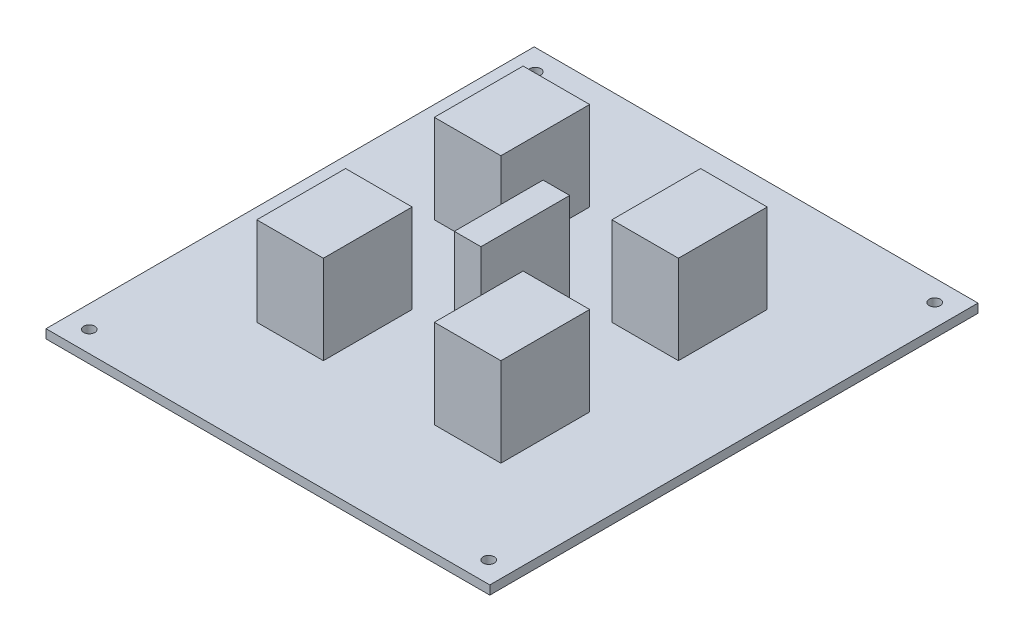
ISO-10303-21;
HEADER;
FILE_DESCRIPTION(('STEP AP214'),'2;1');
FILE_NAME('part.step','',(''),(''),'','','');
FILE_SCHEMA(('AUTOMOTIVE_DESIGN { 1 0 10303 214 1 1 1 1 }'));
ENDSEC;
DATA;
#1=APPLICATION_CONTEXT('core data for automotive mechanical design processes');
#2=APPLICATION_PROTOCOL_DEFINITION('international standard','automotive_design',2000,#1);
#3=PRODUCT_CONTEXT('',#1,'mechanical');
#4=PRODUCT('Part','Part','',(#3));
#5=PRODUCT_RELATED_PRODUCT_CATEGORY('part','',(#4));
#6=PRODUCT_DEFINITION_FORMATION('','',#4);
#7=PRODUCT_DEFINITION_CONTEXT('part definition',#1,'design');
#8=PRODUCT_DEFINITION('design','',#6,#7);
#9=PRODUCT_DEFINITION_SHAPE('','',#8);
#10=(LENGTH_UNIT() NAMED_UNIT(*) SI_UNIT(.MILLI.,.METRE.));
#11=(NAMED_UNIT(*) PLANE_ANGLE_UNIT() SI_UNIT($,.RADIAN.));
#12=(NAMED_UNIT(*) SI_UNIT($,.STERADIAN.) SOLID_ANGLE_UNIT());
#13=UNCERTAINTY_MEASURE_WITH_UNIT(LENGTH_MEASURE(1.E-05),#10,'distance_accuracy_value','');
#14=(GEOMETRIC_REPRESENTATION_CONTEXT(3) GLOBAL_UNCERTAINTY_ASSIGNED_CONTEXT((#13)) GLOBAL_UNIT_ASSIGNED_CONTEXT((#10,
#11,#12)) REPRESENTATION_CONTEXT('',''));
#15=CARTESIAN_POINT('',(0.,0.,0.));
#16=DIRECTION('',(0.,0.,1.));
#17=DIRECTION('',(1.,0.,0.));
#18=AXIS2_PLACEMENT_3D('',#15,#16,#17);
#19=CARTESIAN_POINT('',(0.,2.,0.));
#20=DIRECTION('',(0.,-1.,0.));
#21=DIRECTION('',(0.,0.,-1.));
#22=AXIS2_PLACEMENT_3D('',#19,#20,#21);
#23=PLANE('',#22);
#24=DIRECTION('',(0.,0.,-1.));
#25=VECTOR('',#24,1.);
#26=CARTESIAN_POINT('',(27.5,2.,30.));
#27=LINE('',#26,#25);
#28=CARTESIAN_POINT('',(27.5,2.,30.));
#29=VERTEX_POINT('',#28);
#30=CARTESIAN_POINT('',(27.5,2.,10.));
#31=VERTEX_POINT('',#30);
#32=EDGE_CURVE('E214',#29,#31,#27,.T.);
#33=ORIENTED_EDGE('',*,*,#32,.F.);
#34=DIRECTION('',(1.,0.,0.));
#35=VECTOR('',#34,1.);
#36=CARTESIAN_POINT('',(27.5,2.,30.));
#37=LINE('',#36,#35);
#38=CARTESIAN_POINT('',(12.5,2.,30.));
#39=VERTEX_POINT('',#38);
#40=EDGE_CURVE('E227',#39,#29,#37,.T.);
#41=ORIENTED_EDGE('',*,*,#40,.F.);
#42=DIRECTION('',(0.,0.,1.));
#43=VECTOR('',#42,1.);
#44=CARTESIAN_POINT('',(12.5,2.,30.));
#45=LINE('',#44,#43);
#46=CARTESIAN_POINT('',(12.5,2.,10.));
#47=VERTEX_POINT('',#46);
#48=EDGE_CURVE('E236',#47,#39,#45,.T.);
#49=ORIENTED_EDGE('',*,*,#48,.F.);
#50=DIRECTION('',(-1.,0.,0.));
#51=VECTOR('',#50,1.);
#52=CARTESIAN_POINT('',(27.5,2.,10.));
#53=LINE('',#52,#51);
#54=EDGE_CURVE('E217',#31,#47,#53,.T.);
#55=ORIENTED_EDGE('',*,*,#54,.F.);
#56=EDGE_LOOP('',(#33,#41,#49,#55));
#57=FACE_BOUND('',#56,.T.);
#58=DIRECTION('',(0.,0.,-1.));
#59=VECTOR('',#58,1.);
#60=CARTESIAN_POINT('',(-12.5,2.,30.));
#61=LINE('',#60,#59);
#62=CARTESIAN_POINT('',(-12.5,2.,30.));
#63=VERTEX_POINT('',#62);
#64=CARTESIAN_POINT('',(-12.5,2.,10.));
#65=VERTEX_POINT('',#64);
#66=EDGE_CURVE('E285',#63,#65,#61,.T.);
#67=ORIENTED_EDGE('',*,*,#66,.F.);
#68=DIRECTION('',(1.,0.,0.));
#69=VECTOR('',#68,1.);
#70=CARTESIAN_POINT('',(-27.5,2.,30.));
#71=LINE('',#70,#69);
#72=CARTESIAN_POINT('',(-27.5,2.,30.));
#73=VERTEX_POINT('',#72);
#74=EDGE_CURVE('E290',#73,#63,#71,.T.);
#75=ORIENTED_EDGE('',*,*,#74,.F.);
#76=DIRECTION('',(0.,0.,1.));
#77=VECTOR('',#76,1.);
#78=CARTESIAN_POINT('',(-27.5,2.,30.));
#79=LINE('',#78,#77);
#80=CARTESIAN_POINT('',(-27.5,2.,10.));
#81=VERTEX_POINT('',#80);
#82=EDGE_CURVE('E302',#81,#73,#79,.T.);
#83=ORIENTED_EDGE('',*,*,#82,.F.);
#84=DIRECTION('',(-1.,0.,0.));
#85=VECTOR('',#84,1.);
#86=CARTESIAN_POINT('',(-27.5,2.,10.));
#87=LINE('',#86,#85);
#88=EDGE_CURVE('E299',#65,#81,#87,.T.);
#89=ORIENTED_EDGE('',*,*,#88,.F.);
#90=EDGE_LOOP('',(#67,#75,#83,#89));
#91=FACE_BOUND('',#90,.T.);
#92=CARTESIAN_POINT('',(-45.,2.,50.25));
#93=DIRECTION('',(0.,1.,0.));
#94=DIRECTION('',(0.,0.,-1.));
#95=AXIS2_PLACEMENT_3D('',#92,#93,#94);
#96=CIRCLE('',#95,1.25);
#97=CARTESIAN_POINT('',(-45.,2.,49.));
#98=VERTEX_POINT('',#97);
#99=EDGE_CURVE('E352',#98,#98,#96,.T.);
#100=ORIENTED_EDGE('',*,*,#99,.F.);
#101=EDGE_LOOP('',(#100));
#102=FACE_BOUND('',#101,.T.);
#103=CARTESIAN_POINT('',(45.,2.,50.25));
#104=DIRECTION('',(0.,1.,0.));
#105=DIRECTION('',(0.,0.,-1.));
#106=AXIS2_PLACEMENT_3D('',#103,#104,#105);
#107=CIRCLE('',#106,1.25);
#108=CARTESIAN_POINT('',(45.,2.,49.));
#109=VERTEX_POINT('',#108);
#110=EDGE_CURVE('E358',#109,#109,#107,.T.);
#111=ORIENTED_EDGE('',*,*,#110,.F.);
#112=EDGE_LOOP('',(#111));
#113=FACE_BOUND('',#112,.T.);
#114=CARTESIAN_POINT('',(45.,2.,-50.25));
#115=DIRECTION('',(0.,1.,0.));
#116=DIRECTION('',(0.,0.,1.));
#117=AXIS2_PLACEMENT_3D('',#114,#115,#116);
#118=CIRCLE('',#117,1.25);
#119=CARTESIAN_POINT('',(45.,2.,-49.));
#120=VERTEX_POINT('',#119);
#121=EDGE_CURVE('E364',#120,#120,#118,.T.);
#122=ORIENTED_EDGE('',*,*,#121,.F.);
#123=EDGE_LOOP('',(#122));
#124=FACE_BOUND('',#123,.T.);
#125=CARTESIAN_POINT('',(-45.,2.,-50.25));
#126=DIRECTION('',(0.,1.,0.));
#127=DIRECTION('',(0.,0.,1.));
#128=AXIS2_PLACEMENT_3D('',#125,#126,#127);
#129=CIRCLE('',#128,1.25);
#130=CARTESIAN_POINT('',(-45.,2.,-49.));
#131=VERTEX_POINT('',#130);
#132=EDGE_CURVE('E370',#131,#131,#129,.T.);
#133=ORIENTED_EDGE('',*,*,#132,.F.);
#134=EDGE_LOOP('',(#133));
#135=FACE_BOUND('',#134,.T.);
#136=DIRECTION('',(0.,0.,-1.));
#137=VECTOR('',#136,1.);
#138=CARTESIAN_POINT('',(50.,2.,55.));
#139=LINE('',#138,#137);
#140=CARTESIAN_POINT('',(50.,2.,55.));
#141=VERTEX_POINT('',#140);
#142=CARTESIAN_POINT('',(50.,2.,-55.));
#143=VERTEX_POINT('',#142);
#144=EDGE_CURVE('E376',#141,#143,#139,.T.);
#145=ORIENTED_EDGE('',*,*,#144,.T.);
#146=DIRECTION('',(-1.,0.,0.));
#147=VECTOR('',#146,1.);
#148=CARTESIAN_POINT('',(-50.,2.,-55.));
#149=LINE('',#148,#147);
#150=CARTESIAN_POINT('',(-50.,2.,-55.));
#151=VERTEX_POINT('',#150);
#152=EDGE_CURVE('E379',#143,#151,#149,.T.);
#153=ORIENTED_EDGE('',*,*,#152,.T.);
#154=DIRECTION('',(0.,0.,1.));
#155=VECTOR('',#154,1.);
#156=CARTESIAN_POINT('',(-50.,2.,55.));
#157=LINE('',#156,#155);
#158=CARTESIAN_POINT('',(-50.,2.,55.));
#159=VERTEX_POINT('',#158);
#160=EDGE_CURVE('E382',#151,#159,#157,.T.);
#161=ORIENTED_EDGE('',*,*,#160,.T.);
#162=DIRECTION('',(1.,0.,0.));
#163=VECTOR('',#162,1.);
#164=CARTESIAN_POINT('',(-50.,2.,55.));
#165=LINE('',#164,#163);
#166=EDGE_CURVE('E384',#159,#141,#165,.T.);
#167=ORIENTED_EDGE('',*,*,#166,.T.);
#168=EDGE_LOOP('',(#145,#153,#161,#167));
#169=FACE_BOUND('',#168,.T.);
#170=DIRECTION('',(0.,0.,1.));
#171=VECTOR('',#170,1.);
#172=CARTESIAN_POINT('',(-27.5,2.,-30.));
#173=LINE('',#172,#171);
#174=CARTESIAN_POINT('',(-27.5,2.,-30.));
#175=VERTEX_POINT('',#174);
#176=CARTESIAN_POINT('',(-27.5,2.,-10.));
#177=VERTEX_POINT('',#176);
#178=EDGE_CURVE('E318',#175,#177,#173,.T.);
#179=ORIENTED_EDGE('',*,*,#178,.F.);
#180=DIRECTION('',(-1.,0.,0.));
#181=VECTOR('',#180,1.);
#182=CARTESIAN_POINT('',(-27.5,2.,-30.));
#183=LINE('',#182,#181);
#184=CARTESIAN_POINT('',(-12.5,2.,-30.));
#185=VERTEX_POINT('',#184);
#186=EDGE_CURVE('E323',#185,#175,#183,.T.);
#187=ORIENTED_EDGE('',*,*,#186,.F.);
#188=DIRECTION('',(0.,0.,-1.));
#189=VECTOR('',#188,1.);
#190=CARTESIAN_POINT('',(-12.5,2.,-30.));
#191=LINE('',#190,#189);
#192=CARTESIAN_POINT('',(-12.5,2.,-10.));
#193=VERTEX_POINT('',#192);
#194=EDGE_CURVE('E335',#193,#185,#191,.T.);
#195=ORIENTED_EDGE('',*,*,#194,.F.);
#196=DIRECTION('',(1.,0.,0.));
#197=VECTOR('',#196,1.);
#198=CARTESIAN_POINT('',(-27.5,2.,-10.));
#199=LINE('',#198,#197);
#200=EDGE_CURVE('E332',#177,#193,#199,.T.);
#201=ORIENTED_EDGE('',*,*,#200,.F.);
#202=EDGE_LOOP('',(#179,#187,#195,#201));
#203=FACE_BOUND('',#202,.T.);
#204=DIRECTION('',(0.,0.,1.));
#205=VECTOR('',#204,1.);
#206=CARTESIAN_POINT('',(-2.99999999999999,2.,-10.));
#207=LINE('',#206,#205);
#208=CARTESIAN_POINT('',(-2.99999999999999,2.,-10.));
#209=VERTEX_POINT('',#208);
#210=CARTESIAN_POINT('',(-2.99999999999999,2.,10.));
#211=VERTEX_POINT('',#210);
#212=EDGE_CURVE('E252',#209,#211,#207,.T.);
#213=ORIENTED_EDGE('',*,*,#212,.F.);
#214=DIRECTION('',(-1.,0.,0.));
#215=VECTOR('',#214,1.);
#216=CARTESIAN_POINT('',(3.00000000000002,2.,-10.));
#217=LINE('',#216,#215);
#218=CARTESIAN_POINT('',(3.00000000000002,2.,-10.));
#219=VERTEX_POINT('',#218);
#220=EDGE_CURVE('E257',#219,#209,#217,.T.);
#221=ORIENTED_EDGE('',*,*,#220,.F.);
#222=DIRECTION('',(0.,0.,-1.));
#223=VECTOR('',#222,1.);
#224=CARTESIAN_POINT('',(3.00000000000002,2.,-10.));
#225=LINE('',#224,#223);
#226=CARTESIAN_POINT('',(3.00000000000002,2.,10.));
#227=VERTEX_POINT('',#226);
#228=EDGE_CURVE('E269',#227,#219,#225,.T.);
#229=ORIENTED_EDGE('',*,*,#228,.F.);
#230=DIRECTION('',(1.,0.,0.));
#231=VECTOR('',#230,1.);
#232=CARTESIAN_POINT('',(-2.99999999999999,2.,10.));
#233=LINE('',#232,#231);
#234=EDGE_CURVE('E266',#211,#227,#233,.T.);
#235=ORIENTED_EDGE('',*,*,#234,.F.);
#236=EDGE_LOOP('',(#213,#221,#229,#235));
#237=FACE_BOUND('',#236,.T.);
#238=DIRECTION('',(0.,0.,-1.));
#239=VECTOR('',#238,1.);
#240=CARTESIAN_POINT('',(27.5,2.,-30.));
#241=LINE('',#240,#239);
#242=CARTESIAN_POINT('',(27.5,2.,-10.));
#243=VERTEX_POINT('',#242);
#244=CARTESIAN_POINT('',(27.5,2.,-30.));
#245=VERTEX_POINT('',#244);
#246=EDGE_CURVE('E213',#243,#245,#241,.T.);
#247=ORIENTED_EDGE('',*,*,#246,.F.);
#248=DIRECTION('',(1.,0.,0.));
#249=VECTOR('',#248,1.);
#250=CARTESIAN_POINT('',(27.5,2.,-10.));
#251=LINE('',#250,#249);
#252=CARTESIAN_POINT('',(12.5,2.,-10.));
#253=VERTEX_POINT('',#252);
#254=EDGE_CURVE('E210',#253,#243,#251,.T.);
#255=ORIENTED_EDGE('',*,*,#254,.F.);
#256=DIRECTION('',(0.,0.,1.));
#257=VECTOR('',#256,1.);
#258=CARTESIAN_POINT('',(12.5,2.,-30.));
#259=LINE('',#258,#257);
#260=CARTESIAN_POINT('',(12.5,2.,-30.));
#261=VERTEX_POINT('',#260);
#262=EDGE_CURVE('E52',#261,#253,#259,.T.);
#263=ORIENTED_EDGE('',*,*,#262,.F.);
#264=DIRECTION('',(-1.,0.,0.));
#265=VECTOR('',#264,1.);
#266=CARTESIAN_POINT('',(27.5,2.,-30.));
#267=LINE('',#266,#265);
#268=EDGE_CURVE('E47',#245,#261,#267,.T.);
#269=ORIENTED_EDGE('',*,*,#268,.F.);
#270=EDGE_LOOP('',(#247,#255,#263,#269));
#271=FACE_BOUND('',#270,.T.);
#272=ADVANCED_FACE('F32',(#57,#91,#102,#113,#124,#135,#169,#203,#237,#271),#23,.F.);
#273=CARTESIAN_POINT('',(0.,0.,0.));
#274=DIRECTION('',(0.,-1.,0.));
#275=DIRECTION('',(0.,0.,-1.));
#276=AXIS2_PLACEMENT_3D('',#273,#274,#275);
#277=PLANE('',#276);
#278=CARTESIAN_POINT('',(45.,0.,50.25));
#279=DIRECTION('',(0.,1.,0.));
#280=DIRECTION('',(0.,0.,-1.));
#281=AXIS2_PLACEMENT_3D('',#278,#279,#280);
#282=CIRCLE('',#281,1.25);
#283=CARTESIAN_POINT('',(45.,0.,49.));
#284=VERTEX_POINT('',#283);
#285=EDGE_CURVE('E355',#284,#284,#282,.T.);
#286=ORIENTED_EDGE('',*,*,#285,.T.);
#287=EDGE_LOOP('',(#286));
#288=FACE_BOUND('',#287,.T.);
#289=CARTESIAN_POINT('',(-45.,0.,-50.25));
#290=DIRECTION('',(0.,1.,0.));
#291=DIRECTION('',(0.,0.,1.));
#292=AXIS2_PLACEMENT_3D('',#289,#290,#291);
#293=CIRCLE('',#292,1.25);
#294=CARTESIAN_POINT('',(-45.,0.,-49.));
#295=VERTEX_POINT('',#294);
#296=EDGE_CURVE('E367',#295,#295,#293,.T.);
#297=ORIENTED_EDGE('',*,*,#296,.T.);
#298=EDGE_LOOP('',(#297));
#299=FACE_BOUND('',#298,.T.);
#300=DIRECTION('',(0.,0.,-1.));
#301=VECTOR('',#300,1.);
#302=CARTESIAN_POINT('',(50.,0.,55.));
#303=LINE('',#302,#301);
#304=CARTESIAN_POINT('',(50.,0.,55.));
#305=VERTEX_POINT('',#304);
#306=CARTESIAN_POINT('',(50.,0.,-55.));
#307=VERTEX_POINT('',#306);
#308=EDGE_CURVE('E373',#305,#307,#303,.T.);
#309=ORIENTED_EDGE('',*,*,#308,.F.);
#310=DIRECTION('',(1.,0.,0.));
#311=VECTOR('',#310,1.);
#312=CARTESIAN_POINT('',(-50.,0.,55.));
#313=LINE('',#312,#311);
#314=CARTESIAN_POINT('',(-50.,0.,55.));
#315=VERTEX_POINT('',#314);
#316=EDGE_CURVE('E380',#315,#305,#313,.T.);
#317=ORIENTED_EDGE('',*,*,#316,.F.);
#318=DIRECTION('',(0.,0.,1.));
#319=VECTOR('',#318,1.);
#320=CARTESIAN_POINT('',(-50.,0.,55.));
#321=LINE('',#320,#319);
#322=CARTESIAN_POINT('',(-50.,0.,-55.));
#323=VERTEX_POINT('',#322);
#324=EDGE_CURVE('E391',#323,#315,#321,.T.);
#325=ORIENTED_EDGE('',*,*,#324,.F.);
#326=DIRECTION('',(-1.,0.,0.));
#327=VECTOR('',#326,1.);
#328=CARTESIAN_POINT('',(-50.,0.,-55.));
#329=LINE('',#328,#327);
#330=EDGE_CURVE('E389',#307,#323,#329,.T.);
#331=ORIENTED_EDGE('',*,*,#330,.F.);
#332=EDGE_LOOP('',(#309,#317,#325,#331));
#333=FACE_BOUND('',#332,.T.);
#334=CARTESIAN_POINT('',(45.,0.,-50.25));
#335=DIRECTION('',(0.,1.,0.));
#336=DIRECTION('',(0.,0.,1.));
#337=AXIS2_PLACEMENT_3D('',#334,#335,#336);
#338=CIRCLE('',#337,1.25);
#339=CARTESIAN_POINT('',(45.,0.,-49.));
#340=VERTEX_POINT('',#339);
#341=EDGE_CURVE('E361',#340,#340,#338,.T.);
#342=ORIENTED_EDGE('',*,*,#341,.T.);
#343=EDGE_LOOP('',(#342));
#344=FACE_BOUND('',#343,.T.);
#345=CARTESIAN_POINT('',(-45.,0.,50.25));
#346=DIRECTION('',(0.,1.,0.));
#347=DIRECTION('',(0.,0.,-1.));
#348=AXIS2_PLACEMENT_3D('',#345,#346,#347);
#349=CIRCLE('',#348,1.25);
#350=CARTESIAN_POINT('',(-45.,0.,49.));
#351=VERTEX_POINT('',#350);
#352=EDGE_CURVE('E351',#351,#351,#349,.T.);
#353=ORIENTED_EDGE('',*,*,#352,.T.);
#354=EDGE_LOOP('',(#353));
#355=FACE_BOUND('',#354,.T.);
#356=ADVANCED_FACE('F409',(#288,#299,#333,#344,#355),#277,.T.);
#357=CARTESIAN_POINT('',(50.,2.,55.));
#358=DIRECTION('',(-1.,0.,0.));
#359=DIRECTION('',(0.,0.,1.));
#360=AXIS2_PLACEMENT_3D('',#357,#358,#359);
#361=PLANE('',#360);
#362=ORIENTED_EDGE('',*,*,#308,.T.);
#363=DIRECTION('',(0.,-1.,0.));
#364=VECTOR('',#363,1.);
#365=CARTESIAN_POINT('',(50.,2.,-55.));
#366=LINE('',#365,#364);
#367=EDGE_CURVE('E11',#143,#307,#366,.T.);
#368=ORIENTED_EDGE('',*,*,#367,.F.);
#369=ORIENTED_EDGE('',*,*,#144,.F.);
#370=DIRECTION('',(0.,-1.,0.));
#371=VECTOR('',#370,1.);
#372=CARTESIAN_POINT('',(50.,2.,55.));
#373=LINE('',#372,#371);
#374=EDGE_CURVE('E386',#141,#305,#373,.T.);
#375=ORIENTED_EDGE('',*,*,#374,.T.);
#376=EDGE_LOOP('',(#362,#368,#369,#375));
#377=FACE_BOUND('',#376,.T.);
#378=ADVANCED_FACE('F34',(#377),#361,.F.);
#379=CARTESIAN_POINT('',(-50.,2.,-55.));
#380=DIRECTION('',(0.,0.,1.));
#381=DIRECTION('',(1.,0.,0.));
#382=AXIS2_PLACEMENT_3D('',#379,#380,#381);
#383=PLANE('',#382);
#384=ORIENTED_EDGE('',*,*,#330,.T.);
#385=DIRECTION('',(0.,-1.,0.));
#386=VECTOR('',#385,1.);
#387=CARTESIAN_POINT('',(-50.,2.,-55.));
#388=LINE('',#387,#386);
#389=EDGE_CURVE('E40',#151,#323,#388,.T.);
#390=ORIENTED_EDGE('',*,*,#389,.F.);
#391=ORIENTED_EDGE('',*,*,#152,.F.);
#392=ORIENTED_EDGE('',*,*,#367,.T.);
#393=EDGE_LOOP('',(#384,#390,#391,#392));
#394=FACE_BOUND('',#393,.T.);
#395=ADVANCED_FACE('F420',(#394),#383,.F.);
#396=CARTESIAN_POINT('',(-50.,2.,55.));
#397=DIRECTION('',(1.,0.,0.));
#398=DIRECTION('',(0.,0.,-1.));
#399=AXIS2_PLACEMENT_3D('',#396,#397,#398);
#400=PLANE('',#399);
#401=ORIENTED_EDGE('',*,*,#324,.T.);
#402=DIRECTION('',(0.,-1.,0.));
#403=VECTOR('',#402,1.);
#404=CARTESIAN_POINT('',(-50.,2.,55.));
#405=LINE('',#404,#403);
#406=EDGE_CURVE('E396',#159,#315,#405,.T.);
#407=ORIENTED_EDGE('',*,*,#406,.F.);
#408=ORIENTED_EDGE('',*,*,#160,.F.);
#409=ORIENTED_EDGE('',*,*,#389,.T.);
#410=EDGE_LOOP('',(#401,#407,#408,#409));
#411=FACE_BOUND('',#410,.T.);
#412=ADVANCED_FACE('F403',(#411),#400,.F.);
#413=CARTESIAN_POINT('',(-50.,2.,55.));
#414=DIRECTION('',(0.,0.,-1.));
#415=DIRECTION('',(-1.,0.,0.));
#416=AXIS2_PLACEMENT_3D('',#413,#414,#415);
#417=PLANE('',#416);
#418=ORIENTED_EDGE('',*,*,#316,.T.);
#419=ORIENTED_EDGE('',*,*,#374,.F.);
#420=ORIENTED_EDGE('',*,*,#166,.F.);
#421=ORIENTED_EDGE('',*,*,#406,.T.);
#422=EDGE_LOOP('',(#418,#419,#420,#421));
#423=FACE_BOUND('',#422,.T.);
#424=ADVANCED_FACE('F413',(#423),#417,.F.);
#425=CARTESIAN_POINT('',(-45.,2.,-50.25));
#426=DIRECTION('',(0.,-1.,0.));
#427=DIRECTION('',(0.,0.,-1.));
#428=AXIS2_PLACEMENT_3D('',#425,#426,#427);
#429=CYLINDRICAL_SURFACE('',#428,1.25);
#430=ORIENTED_EDGE('',*,*,#132,.T.);
#431=EDGE_LOOP('',(#430));
#432=FACE_BOUND('',#431,.T.);
#433=ORIENTED_EDGE('',*,*,#296,.F.);
#434=EDGE_LOOP('',(#433));
#435=FACE_BOUND('',#434,.T.);
#436=ADVANCED_FACE('F437',(#432,#435),#429,.F.);
#437=CARTESIAN_POINT('',(45.,2.,-50.25));
#438=DIRECTION('',(0.,-1.,0.));
#439=DIRECTION('',(0.,0.,-1.));
#440=AXIS2_PLACEMENT_3D('',#437,#438,#439);
#441=CYLINDRICAL_SURFACE('',#440,1.25);
#442=ORIENTED_EDGE('',*,*,#121,.T.);
#443=EDGE_LOOP('',(#442));
#444=FACE_BOUND('',#443,.T.);
#445=ORIENTED_EDGE('',*,*,#341,.F.);
#446=EDGE_LOOP('',(#445));
#447=FACE_BOUND('',#446,.T.);
#448=ADVANCED_FACE('F444',(#444,#447),#441,.F.);
#449=CARTESIAN_POINT('',(45.,2.,50.25));
#450=DIRECTION('',(0.,-1.,0.));
#451=DIRECTION('',(0.,0.,-1.));
#452=AXIS2_PLACEMENT_3D('',#449,#450,#451);
#453=CYLINDRICAL_SURFACE('',#452,1.25);
#454=ORIENTED_EDGE('',*,*,#110,.T.);
#455=EDGE_LOOP('',(#454));
#456=FACE_BOUND('',#455,.T.);
#457=ORIENTED_EDGE('',*,*,#285,.F.);
#458=EDGE_LOOP('',(#457));
#459=FACE_BOUND('',#458,.T.);
#460=ADVANCED_FACE('F449',(#456,#459),#453,.F.);
#461=CARTESIAN_POINT('',(-45.,2.,50.25));
#462=DIRECTION('',(0.,-1.,0.));
#463=DIRECTION('',(0.,0.,-1.));
#464=AXIS2_PLACEMENT_3D('',#461,#462,#463);
#465=CYLINDRICAL_SURFACE('',#464,1.25);
#466=ORIENTED_EDGE('',*,*,#99,.T.);
#467=EDGE_LOOP('',(#466));
#468=FACE_BOUND('',#467,.T.);
#469=ORIENTED_EDGE('',*,*,#352,.F.);
#470=EDGE_LOOP('',(#469));
#471=FACE_BOUND('',#470,.T.);
#472=ADVANCED_FACE('F459',(#468,#471),#465,.F.);
#473=CARTESIAN_POINT('',(-27.5,22.,-30.));
#474=DIRECTION('',(1.,0.,0.));
#475=DIRECTION('',(0.,0.,-1.));
#476=AXIS2_PLACEMENT_3D('',#473,#474,#475);
#477=PLANE('',#476);
#478=ORIENTED_EDGE('',*,*,#178,.T.);
#479=DIRECTION('',(0.,-1.,0.));
#480=VECTOR('',#479,1.);
#481=CARTESIAN_POINT('',(-27.5,22.,-10.));
#482=LINE('',#481,#480);
#483=CARTESIAN_POINT('',(-27.5,22.,-10.));
#484=VERTEX_POINT('',#483);
#485=EDGE_CURVE('E348',#484,#177,#482,.T.);
#486=ORIENTED_EDGE('',*,*,#485,.F.);
#487=DIRECTION('',(0.,0.,1.));
#488=VECTOR('',#487,1.);
#489=CARTESIAN_POINT('',(-27.5,22.,-30.));
#490=LINE('',#489,#488);
#491=CARTESIAN_POINT('',(-27.5,22.,-30.));
#492=VERTEX_POINT('',#491);
#493=EDGE_CURVE('E319',#492,#484,#490,.T.);
#494=ORIENTED_EDGE('',*,*,#493,.F.);
#495=DIRECTION('',(0.,-1.,0.));
#496=VECTOR('',#495,1.);
#497=CARTESIAN_POINT('',(-27.5,22.,-30.));
#498=LINE('',#497,#496);
#499=EDGE_CURVE('E329',#492,#175,#498,.T.);
#500=ORIENTED_EDGE('',*,*,#499,.T.);
#501=EDGE_LOOP('',(#478,#486,#494,#500));
#502=FACE_BOUND('',#501,.T.);
#503=ADVANCED_FACE('F466',(#502),#477,.F.);
#504=CARTESIAN_POINT('',(-27.5,22.,-10.));
#505=DIRECTION('',(0.,0.,-1.));
#506=DIRECTION('',(-1.,0.,0.));
#507=AXIS2_PLACEMENT_3D('',#504,#505,#506);
#508=PLANE('',#507);
#509=ORIENTED_EDGE('',*,*,#200,.T.);
#510=DIRECTION('',(0.,-1.,0.));
#511=VECTOR('',#510,1.);
#512=CARTESIAN_POINT('',(-12.5,22.,-10.));
#513=LINE('',#512,#511);
#514=CARTESIAN_POINT('',(-12.5,22.,-10.));
#515=VERTEX_POINT('',#514);
#516=EDGE_CURVE('E345',#515,#193,#513,.T.);
#517=ORIENTED_EDGE('',*,*,#516,.F.);
#518=DIRECTION('',(1.,0.,0.));
#519=VECTOR('',#518,1.);
#520=CARTESIAN_POINT('',(-27.5,22.,-10.));
#521=LINE('',#520,#519);
#522=EDGE_CURVE('E322',#484,#515,#521,.T.);
#523=ORIENTED_EDGE('',*,*,#522,.F.);
#524=ORIENTED_EDGE('',*,*,#485,.T.);
#525=EDGE_LOOP('',(#509,#517,#523,#524));
#526=FACE_BOUND('',#525,.T.);
#527=ADVANCED_FACE('F470',(#526),#508,.F.);
#528=CARTESIAN_POINT('',(-12.5,22.,-30.));
#529=DIRECTION('',(-1.,0.,0.));
#530=DIRECTION('',(0.,0.,1.));
#531=AXIS2_PLACEMENT_3D('',#528,#529,#530);
#532=PLANE('',#531);
#533=ORIENTED_EDGE('',*,*,#194,.T.);
#534=DIRECTION('',(0.,-1.,0.));
#535=VECTOR('',#534,1.);
#536=CARTESIAN_POINT('',(-12.5,22.,-30.));
#537=LINE('',#536,#535);
#538=CARTESIAN_POINT('',(-12.5,22.,-30.));
#539=VERTEX_POINT('',#538);
#540=EDGE_CURVE('E342',#539,#185,#537,.T.);
#541=ORIENTED_EDGE('',*,*,#540,.F.);
#542=DIRECTION('',(0.,0.,-1.));
#543=VECTOR('',#542,1.);
#544=CARTESIAN_POINT('',(-12.5,22.,-30.));
#545=LINE('',#544,#543);
#546=EDGE_CURVE('E325',#515,#539,#545,.T.);
#547=ORIENTED_EDGE('',*,*,#546,.F.);
#548=ORIENTED_EDGE('',*,*,#516,.T.);
#549=EDGE_LOOP('',(#533,#541,#547,#548));
#550=FACE_BOUND('',#549,.T.);
#551=ADVANCED_FACE('F474',(#550),#532,.F.);
#552=CARTESIAN_POINT('',(-27.5,22.,-30.));
#553=DIRECTION('',(0.,0.,1.));
#554=DIRECTION('',(1.,0.,0.));
#555=AXIS2_PLACEMENT_3D('',#552,#553,#554);
#556=PLANE('',#555);
#557=ORIENTED_EDGE('',*,*,#186,.T.);
#558=ORIENTED_EDGE('',*,*,#499,.F.);
#559=DIRECTION('',(-1.,0.,0.));
#560=VECTOR('',#559,1.);
#561=CARTESIAN_POINT('',(-27.5,22.,-30.));
#562=LINE('',#561,#560);
#563=EDGE_CURVE('E327',#539,#492,#562,.T.);
#564=ORIENTED_EDGE('',*,*,#563,.F.);
#565=ORIENTED_EDGE('',*,*,#540,.T.);
#566=EDGE_LOOP('',(#557,#558,#564,#565));
#567=FACE_BOUND('',#566,.T.);
#568=ADVANCED_FACE('F478',(#567),#556,.F.);
#569=CARTESIAN_POINT('',(0.,22.,0.));
#570=DIRECTION('',(0.,1.,0.));
#571=DIRECTION('',(0.,0.,1.));
#572=AXIS2_PLACEMENT_3D('',#569,#570,#571);
#573=PLANE('',#572);
#574=ORIENTED_EDGE('',*,*,#493,.T.);
#575=ORIENTED_EDGE('',*,*,#522,.T.);
#576=ORIENTED_EDGE('',*,*,#546,.T.);
#577=ORIENTED_EDGE('',*,*,#563,.T.);
#578=EDGE_LOOP('',(#574,#575,#576,#577));
#579=FACE_BOUND('',#578,.T.);
#580=ADVANCED_FACE('F482',(#579),#573,.T.);
#581=CARTESIAN_POINT('',(-12.5,22.,30.));
#582=DIRECTION('',(-1.,0.,0.));
#583=DIRECTION('',(0.,0.,1.));
#584=AXIS2_PLACEMENT_3D('',#581,#582,#583);
#585=PLANE('',#584);
#586=ORIENTED_EDGE('',*,*,#66,.T.);
#587=DIRECTION('',(0.,-1.,0.));
#588=VECTOR('',#587,1.);
#589=CARTESIAN_POINT('',(-12.5,22.,10.));
#590=LINE('',#589,#588);
#591=CARTESIAN_POINT('',(-12.5,22.,10.));
#592=VERTEX_POINT('',#591);
#593=EDGE_CURVE('E315',#592,#65,#590,.T.);
#594=ORIENTED_EDGE('',*,*,#593,.F.);
#595=DIRECTION('',(0.,0.,-1.));
#596=VECTOR('',#595,1.);
#597=CARTESIAN_POINT('',(-12.5,22.,30.));
#598=LINE('',#597,#596);
#599=CARTESIAN_POINT('',(-12.5,22.,30.));
#600=VERTEX_POINT('',#599);
#601=EDGE_CURVE('E286',#600,#592,#598,.T.);
#602=ORIENTED_EDGE('',*,*,#601,.F.);
#603=DIRECTION('',(0.,-1.,0.));
#604=VECTOR('',#603,1.);
#605=CARTESIAN_POINT('',(-12.5,22.,30.));
#606=LINE('',#605,#604);
#607=EDGE_CURVE('E296',#600,#63,#606,.T.);
#608=ORIENTED_EDGE('',*,*,#607,.T.);
#609=EDGE_LOOP('',(#586,#594,#602,#608));
#610=FACE_BOUND('',#609,.T.);
#611=ADVANCED_FACE('F486',(#610),#585,.F.);
#612=CARTESIAN_POINT('',(-27.5,22.,10.));
#613=DIRECTION('',(0.,0.,1.));
#614=DIRECTION('',(1.,0.,0.));
#615=AXIS2_PLACEMENT_3D('',#612,#613,#614);
#616=PLANE('',#615);
#617=ORIENTED_EDGE('',*,*,#88,.T.);
#618=DIRECTION('',(0.,-1.,0.));
#619=VECTOR('',#618,1.);
#620=CARTESIAN_POINT('',(-27.5,22.,10.));
#621=LINE('',#620,#619);
#622=CARTESIAN_POINT('',(-27.5,22.,10.));
#623=VERTEX_POINT('',#622);
#624=EDGE_CURVE('E312',#623,#81,#621,.T.);
#625=ORIENTED_EDGE('',*,*,#624,.F.);
#626=DIRECTION('',(-1.,0.,0.));
#627=VECTOR('',#626,1.);
#628=CARTESIAN_POINT('',(-27.5,22.,10.));
#629=LINE('',#628,#627);
#630=EDGE_CURVE('E289',#592,#623,#629,.T.);
#631=ORIENTED_EDGE('',*,*,#630,.F.);
#632=ORIENTED_EDGE('',*,*,#593,.T.);
#633=EDGE_LOOP('',(#617,#625,#631,#632));
#634=FACE_BOUND('',#633,.T.);
#635=ADVANCED_FACE('F490',(#634),#616,.F.);
#636=CARTESIAN_POINT('',(-27.5,22.,30.));
#637=DIRECTION('',(1.,0.,0.));
#638=DIRECTION('',(0.,0.,-1.));
#639=AXIS2_PLACEMENT_3D('',#636,#637,#638);
#640=PLANE('',#639);
#641=ORIENTED_EDGE('',*,*,#82,.T.);
#642=DIRECTION('',(0.,-1.,0.));
#643=VECTOR('',#642,1.);
#644=CARTESIAN_POINT('',(-27.5,22.,30.));
#645=LINE('',#644,#643);
#646=CARTESIAN_POINT('',(-27.5,22.,30.));
#647=VERTEX_POINT('',#646);
#648=EDGE_CURVE('E309',#647,#73,#645,.T.);
#649=ORIENTED_EDGE('',*,*,#648,.F.);
#650=DIRECTION('',(0.,0.,1.));
#651=VECTOR('',#650,1.);
#652=CARTESIAN_POINT('',(-27.5,22.,30.));
#653=LINE('',#652,#651);
#654=EDGE_CURVE('E292',#623,#647,#653,.T.);
#655=ORIENTED_EDGE('',*,*,#654,.F.);
#656=ORIENTED_EDGE('',*,*,#624,.T.);
#657=EDGE_LOOP('',(#641,#649,#655,#656));
#658=FACE_BOUND('',#657,.T.);
#659=ADVANCED_FACE('F494',(#658),#640,.F.);
#660=CARTESIAN_POINT('',(-27.5,22.,30.));
#661=DIRECTION('',(0.,0.,-1.));
#662=DIRECTION('',(-1.,0.,0.));
#663=AXIS2_PLACEMENT_3D('',#660,#661,#662);
#664=PLANE('',#663);
#665=ORIENTED_EDGE('',*,*,#74,.T.);
#666=ORIENTED_EDGE('',*,*,#607,.F.);
#667=DIRECTION('',(1.,0.,0.));
#668=VECTOR('',#667,1.);
#669=CARTESIAN_POINT('',(-27.5,22.,30.));
#670=LINE('',#669,#668);
#671=EDGE_CURVE('E294',#647,#600,#670,.T.);
#672=ORIENTED_EDGE('',*,*,#671,.F.);
#673=ORIENTED_EDGE('',*,*,#648,.T.);
#674=EDGE_LOOP('',(#665,#666,#672,#673));
#675=FACE_BOUND('',#674,.T.);
#676=ADVANCED_FACE('F498',(#675),#664,.F.);
#677=CARTESIAN_POINT('',(0.,22.,0.));
#678=DIRECTION('',(0.,-1.,0.));
#679=DIRECTION('',(0.,0.,-1.));
#680=AXIS2_PLACEMENT_3D('',#677,#678,#679);
#681=PLANE('',#680);
#682=ORIENTED_EDGE('',*,*,#601,.T.);
#683=ORIENTED_EDGE('',*,*,#630,.T.);
#684=ORIENTED_EDGE('',*,*,#654,.T.);
#685=ORIENTED_EDGE('',*,*,#671,.T.);
#686=EDGE_LOOP('',(#682,#683,#684,#685));
#687=FACE_BOUND('',#686,.T.);
#688=ADVANCED_FACE('F502',(#687),#681,.F.);
#689=CARTESIAN_POINT('',(-2.99999999999999,22.,-10.));
#690=DIRECTION('',(1.,0.,0.));
#691=DIRECTION('',(0.,0.,-1.));
#692=AXIS2_PLACEMENT_3D('',#689,#690,#691);
#693=PLANE('',#692);
#694=ORIENTED_EDGE('',*,*,#212,.T.);
#695=DIRECTION('',(0.,-1.,0.));
#696=VECTOR('',#695,1.);
#697=CARTESIAN_POINT('',(-2.99999999999999,22.,10.));
#698=LINE('',#697,#696);
#699=CARTESIAN_POINT('',(-2.99999999999999,22.,10.));
#700=VERTEX_POINT('',#699);
#701=EDGE_CURVE('E282',#700,#211,#698,.T.);
#702=ORIENTED_EDGE('',*,*,#701,.F.);
#703=DIRECTION('',(0.,0.,1.));
#704=VECTOR('',#703,1.);
#705=CARTESIAN_POINT('',(-2.99999999999999,22.,-10.));
#706=LINE('',#705,#704);
#707=CARTESIAN_POINT('',(-2.99999999999999,22.,-10.));
#708=VERTEX_POINT('',#707);
#709=EDGE_CURVE('E253',#708,#700,#706,.T.);
#710=ORIENTED_EDGE('',*,*,#709,.F.);
#711=DIRECTION('',(0.,-1.,0.));
#712=VECTOR('',#711,1.);
#713=CARTESIAN_POINT('',(-2.99999999999999,22.,-10.));
#714=LINE('',#713,#712);
#715=EDGE_CURVE('E263',#708,#209,#714,.T.);
#716=ORIENTED_EDGE('',*,*,#715,.T.);
#717=EDGE_LOOP('',(#694,#702,#710,#716));
#718=FACE_BOUND('',#717,.T.);
#719=ADVANCED_FACE('F506',(#718),#693,.F.);
#720=CARTESIAN_POINT('',(-2.99999999999999,22.,10.));
#721=DIRECTION('',(0.,0.,-1.));
#722=DIRECTION('',(-1.,0.,0.));
#723=AXIS2_PLACEMENT_3D('',#720,#721,#722);
#724=PLANE('',#723);
#725=ORIENTED_EDGE('',*,*,#234,.T.);
#726=DIRECTION('',(0.,-1.,0.));
#727=VECTOR('',#726,1.);
#728=CARTESIAN_POINT('',(3.00000000000002,22.,10.));
#729=LINE('',#728,#727);
#730=CARTESIAN_POINT('',(3.00000000000002,22.,10.));
#731=VERTEX_POINT('',#730);
#732=EDGE_CURVE('E279',#731,#227,#729,.T.);
#733=ORIENTED_EDGE('',*,*,#732,.F.);
#734=DIRECTION('',(1.,0.,0.));
#735=VECTOR('',#734,1.);
#736=CARTESIAN_POINT('',(-2.99999999999999,22.,10.));
#737=LINE('',#736,#735);
#738=EDGE_CURVE('E256',#700,#731,#737,.T.);
#739=ORIENTED_EDGE('',*,*,#738,.F.);
#740=ORIENTED_EDGE('',*,*,#701,.T.);
#741=EDGE_LOOP('',(#725,#733,#739,#740));
#742=FACE_BOUND('',#741,.T.);
#743=ADVANCED_FACE('F510',(#742),#724,.F.);
#744=CARTESIAN_POINT('',(3.00000000000002,22.,-10.));
#745=DIRECTION('',(-1.,0.,0.));
#746=DIRECTION('',(0.,0.,1.));
#747=AXIS2_PLACEMENT_3D('',#744,#745,#746);
#748=PLANE('',#747);
#749=ORIENTED_EDGE('',*,*,#228,.T.);
#750=DIRECTION('',(0.,-1.,0.));
#751=VECTOR('',#750,1.);
#752=CARTESIAN_POINT('',(3.00000000000002,22.,-10.));
#753=LINE('',#752,#751);
#754=CARTESIAN_POINT('',(3.00000000000002,22.,-10.));
#755=VERTEX_POINT('',#754);
#756=EDGE_CURVE('E276',#755,#219,#753,.T.);
#757=ORIENTED_EDGE('',*,*,#756,.F.);
#758=DIRECTION('',(0.,0.,-1.));
#759=VECTOR('',#758,1.);
#760=CARTESIAN_POINT('',(3.00000000000002,22.,-10.));
#761=LINE('',#760,#759);
#762=EDGE_CURVE('E259',#731,#755,#761,.T.);
#763=ORIENTED_EDGE('',*,*,#762,.F.);
#764=ORIENTED_EDGE('',*,*,#732,.T.);
#765=EDGE_LOOP('',(#749,#757,#763,#764));
#766=FACE_BOUND('',#765,.T.);
#767=ADVANCED_FACE('F514',(#766),#748,.F.);
#768=CARTESIAN_POINT('',(3.00000000000002,22.,-10.));
#769=DIRECTION('',(0.,0.,1.));
#770=DIRECTION('',(1.,0.,0.));
#771=AXIS2_PLACEMENT_3D('',#768,#769,#770);
#772=PLANE('',#771);
#773=ORIENTED_EDGE('',*,*,#220,.T.);
#774=ORIENTED_EDGE('',*,*,#715,.F.);
#775=DIRECTION('',(-1.,0.,0.));
#776=VECTOR('',#775,1.);
#777=CARTESIAN_POINT('',(3.00000000000002,22.,-10.));
#778=LINE('',#777,#776);
#779=EDGE_CURVE('E261',#755,#708,#778,.T.);
#780=ORIENTED_EDGE('',*,*,#779,.F.);
#781=ORIENTED_EDGE('',*,*,#756,.T.);
#782=EDGE_LOOP('',(#773,#774,#780,#781));
#783=FACE_BOUND('',#782,.T.);
#784=ADVANCED_FACE('F518',(#783),#772,.F.);
#785=CARTESIAN_POINT('',(0.,22.,0.));
#786=DIRECTION('',(0.,1.,0.));
#787=DIRECTION('',(0.,0.,1.));
#788=AXIS2_PLACEMENT_3D('',#785,#786,#787);
#789=PLANE('',#788);
#790=ORIENTED_EDGE('',*,*,#709,.T.);
#791=ORIENTED_EDGE('',*,*,#738,.T.);
#792=ORIENTED_EDGE('',*,*,#762,.T.);
#793=ORIENTED_EDGE('',*,*,#779,.T.);
#794=EDGE_LOOP('',(#790,#791,#792,#793));
#795=FACE_BOUND('',#794,.T.);
#796=ADVANCED_FACE('F522',(#795),#789,.T.);
#797=CARTESIAN_POINT('',(27.5,22.,30.));
#798=DIRECTION('',(-1.,0.,0.));
#799=DIRECTION('',(0.,0.,1.));
#800=AXIS2_PLACEMENT_3D('',#797,#798,#799);
#801=PLANE('',#800);
#802=ORIENTED_EDGE('',*,*,#32,.T.);
#803=DIRECTION('',(0.,-1.,0.));
#804=VECTOR('',#803,1.);
#805=CARTESIAN_POINT('',(27.5,22.,10.));
#806=LINE('',#805,#804);
#807=CARTESIAN_POINT('',(27.5,22.,10.));
#808=VERTEX_POINT('',#807);
#809=EDGE_CURVE('E249',#808,#31,#806,.T.);
#810=ORIENTED_EDGE('',*,*,#809,.F.);
#811=DIRECTION('',(0.,0.,-1.));
#812=VECTOR('',#811,1.);
#813=CARTESIAN_POINT('',(27.5,22.,30.));
#814=LINE('',#813,#812);
#815=CARTESIAN_POINT('',(27.5,22.,30.));
#816=VERTEX_POINT('',#815);
#817=EDGE_CURVE('E223',#816,#808,#814,.T.);
#818=ORIENTED_EDGE('',*,*,#817,.F.);
#819=DIRECTION('',(0.,-1.,0.));
#820=VECTOR('',#819,1.);
#821=CARTESIAN_POINT('',(27.5,22.,30.));
#822=LINE('',#821,#820);
#823=EDGE_CURVE('E232',#816,#29,#822,.T.);
#824=ORIENTED_EDGE('',*,*,#823,.T.);
#825=EDGE_LOOP('',(#802,#810,#818,#824));
#826=FACE_BOUND('',#825,.T.);
#827=ADVANCED_FACE('F526',(#826),#801,.F.);
#828=CARTESIAN_POINT('',(27.5,22.,10.));
#829=DIRECTION('',(0.,0.,1.));
#830=DIRECTION('',(1.,0.,0.));
#831=AXIS2_PLACEMENT_3D('',#828,#829,#830);
#832=PLANE('',#831);
#833=ORIENTED_EDGE('',*,*,#54,.T.);
#834=DIRECTION('',(0.,-1.,0.));
#835=VECTOR('',#834,1.);
#836=CARTESIAN_POINT('',(12.5,22.,10.));
#837=LINE('',#836,#835);
#838=CARTESIAN_POINT('',(12.5,22.,10.));
#839=VERTEX_POINT('',#838);
#840=EDGE_CURVE('E246',#839,#47,#837,.T.);
#841=ORIENTED_EDGE('',*,*,#840,.F.);
#842=DIRECTION('',(-1.,0.,0.));
#843=VECTOR('',#842,1.);
#844=CARTESIAN_POINT('',(27.5,22.,10.));
#845=LINE('',#844,#843);
#846=EDGE_CURVE('E226',#808,#839,#845,.T.);
#847=ORIENTED_EDGE('',*,*,#846,.F.);
#848=ORIENTED_EDGE('',*,*,#809,.T.);
#849=EDGE_LOOP('',(#833,#841,#847,#848));
#850=FACE_BOUND('',#849,.T.);
#851=ADVANCED_FACE('F530',(#850),#832,.F.);
#852=CARTESIAN_POINT('',(12.5,22.,30.));
#853=DIRECTION('',(1.,0.,0.));
#854=DIRECTION('',(0.,0.,-1.));
#855=AXIS2_PLACEMENT_3D('',#852,#853,#854);
#856=PLANE('',#855);
#857=ORIENTED_EDGE('',*,*,#48,.T.);
#858=DIRECTION('',(0.,-1.,0.));
#859=VECTOR('',#858,1.);
#860=CARTESIAN_POINT('',(12.5,22.,30.));
#861=LINE('',#860,#859);
#862=CARTESIAN_POINT('',(12.5,22.,30.));
#863=VERTEX_POINT('',#862);
#864=EDGE_CURVE('E243',#863,#39,#861,.T.);
#865=ORIENTED_EDGE('',*,*,#864,.F.);
#866=DIRECTION('',(0.,0.,1.));
#867=VECTOR('',#866,1.);
#868=CARTESIAN_POINT('',(12.5,22.,30.));
#869=LINE('',#868,#867);
#870=EDGE_CURVE('E229',#839,#863,#869,.T.);
#871=ORIENTED_EDGE('',*,*,#870,.F.);
#872=ORIENTED_EDGE('',*,*,#840,.T.);
#873=EDGE_LOOP('',(#857,#865,#871,#872));
#874=FACE_BOUND('',#873,.T.);
#875=ADVANCED_FACE('F534',(#874),#856,.F.);
#876=CARTESIAN_POINT('',(27.5,22.,30.));
#877=DIRECTION('',(0.,0.,-1.));
#878=DIRECTION('',(-1.,0.,0.));
#879=AXIS2_PLACEMENT_3D('',#876,#877,#878);
#880=PLANE('',#879);
#881=ORIENTED_EDGE('',*,*,#40,.T.);
#882=ORIENTED_EDGE('',*,*,#823,.F.);
#883=DIRECTION('',(1.,0.,0.));
#884=VECTOR('',#883,1.);
#885=CARTESIAN_POINT('',(27.5,22.,30.));
#886=LINE('',#885,#884);
#887=EDGE_CURVE('E231',#863,#816,#886,.T.);
#888=ORIENTED_EDGE('',*,*,#887,.F.);
#889=ORIENTED_EDGE('',*,*,#864,.T.);
#890=EDGE_LOOP('',(#881,#882,#888,#889));
#891=FACE_BOUND('',#890,.T.);
#892=ADVANCED_FACE('F538',(#891),#880,.F.);
#893=CARTESIAN_POINT('',(0.,22.,0.));
#894=DIRECTION('',(0.,1.,0.));
#895=DIRECTION('',(0.,0.,1.));
#896=AXIS2_PLACEMENT_3D('',#893,#894,#895);
#897=PLANE('',#896);
#898=ORIENTED_EDGE('',*,*,#817,.T.);
#899=ORIENTED_EDGE('',*,*,#846,.T.);
#900=ORIENTED_EDGE('',*,*,#870,.T.);
#901=ORIENTED_EDGE('',*,*,#887,.T.);
#902=EDGE_LOOP('',(#898,#899,#900,#901));
#903=FACE_BOUND('',#902,.T.);
#904=ADVANCED_FACE('F542',(#903),#897,.T.);
#905=CARTESIAN_POINT('',(27.5,22.,-30.));
#906=DIRECTION('',(-1.,0.,0.));
#907=DIRECTION('',(0.,0.,1.));
#908=AXIS2_PLACEMENT_3D('',#905,#906,#907);
#909=PLANE('',#908);
#910=ORIENTED_EDGE('',*,*,#246,.T.);
#911=DIRECTION('',(0.,-1.,0.));
#912=VECTOR('',#911,1.);
#913=CARTESIAN_POINT('',(27.5,22.,-30.));
#914=LINE('',#913,#912);
#915=CARTESIAN_POINT('',(27.5,22.,-30.));
#916=VERTEX_POINT('',#915);
#917=EDGE_CURVE('E194',#916,#245,#914,.T.);
#918=ORIENTED_EDGE('',*,*,#917,.F.);
#919=DIRECTION('',(0.,0.,-1.));
#920=VECTOR('',#919,1.);
#921=CARTESIAN_POINT('',(27.5,22.,-30.));
#922=LINE('',#921,#920);
#923=CARTESIAN_POINT('',(27.5,22.,-10.));
#924=VERTEX_POINT('',#923);
#925=EDGE_CURVE('E201',#924,#916,#922,.T.);
#926=ORIENTED_EDGE('',*,*,#925,.F.);
#927=DIRECTION('',(0.,-1.,0.));
#928=VECTOR('',#927,1.);
#929=CARTESIAN_POINT('',(27.5,22.,-10.));
#930=LINE('',#929,#928);
#931=EDGE_CURVE('E762',#924,#243,#930,.T.);
#932=ORIENTED_EDGE('',*,*,#931,.T.);
#933=EDGE_LOOP('',(#910,#918,#926,#932));
#934=FACE_BOUND('',#933,.T.);
#935=ADVANCED_FACE('F212',(#934),#909,.F.);
#936=CARTESIAN_POINT('',(27.5,22.,-30.));
#937=DIRECTION('',(0.,0.,1.));
#938=DIRECTION('',(1.,0.,0.));
#939=AXIS2_PLACEMENT_3D('',#936,#937,#938);
#940=PLANE('',#939);
#941=ORIENTED_EDGE('',*,*,#268,.T.);
#942=DIRECTION('',(0.,-1.,0.));
#943=VECTOR('',#942,1.);
#944=CARTESIAN_POINT('',(12.5,22.,-30.));
#945=LINE('',#944,#943);
#946=CARTESIAN_POINT('',(12.5,22.,-30.));
#947=VERTEX_POINT('',#946);
#948=EDGE_CURVE('E197',#947,#261,#945,.T.);
#949=ORIENTED_EDGE('',*,*,#948,.F.);
#950=DIRECTION('',(-1.,0.,0.));
#951=VECTOR('',#950,1.);
#952=CARTESIAN_POINT('',(27.5,22.,-30.));
#953=LINE('',#952,#951);
#954=EDGE_CURVE('E190',#916,#947,#953,.T.);
#955=ORIENTED_EDGE('',*,*,#954,.F.);
#956=ORIENTED_EDGE('',*,*,#917,.T.);
#957=EDGE_LOOP('',(#941,#949,#955,#956));
#958=FACE_BOUND('',#957,.T.);
#959=ADVANCED_FACE('F192',(#958),#940,.F.);
#960=CARTESIAN_POINT('',(12.5,22.,-30.));
#961=DIRECTION('',(1.,0.,0.));
#962=DIRECTION('',(0.,0.,-1.));
#963=AXIS2_PLACEMENT_3D('',#960,#961,#962);
#964=PLANE('',#963);
#965=ORIENTED_EDGE('',*,*,#262,.T.);
#966=DIRECTION('',(0.,-1.,0.));
#967=VECTOR('',#966,1.);
#968=CARTESIAN_POINT('',(12.5,22.,-10.));
#969=LINE('',#968,#967);
#970=CARTESIAN_POINT('',(12.5,22.,-10.));
#971=VERTEX_POINT('',#970);
#972=EDGE_CURVE('E219',#971,#253,#969,.T.);
#973=ORIENTED_EDGE('',*,*,#972,.F.);
#974=DIRECTION('',(0.,0.,1.));
#975=VECTOR('',#974,1.);
#976=CARTESIAN_POINT('',(12.5,22.,-30.));
#977=LINE('',#976,#975);
#978=EDGE_CURVE('E200',#947,#971,#977,.T.);
#979=ORIENTED_EDGE('',*,*,#978,.F.);
#980=ORIENTED_EDGE('',*,*,#948,.T.);
#981=EDGE_LOOP('',(#965,#973,#979,#980));
#982=FACE_BOUND('',#981,.T.);
#983=ADVANCED_FACE('F551',(#982),#964,.F.);
#984=CARTESIAN_POINT('',(27.5,22.,-10.));
#985=DIRECTION('',(0.,0.,-1.));
#986=DIRECTION('',(-1.,0.,0.));
#987=AXIS2_PLACEMENT_3D('',#984,#985,#986);
#988=PLANE('',#987);
#989=ORIENTED_EDGE('',*,*,#254,.T.);
#990=ORIENTED_EDGE('',*,*,#931,.F.);
#991=DIRECTION('',(1.,0.,0.));
#992=VECTOR('',#991,1.);
#993=CARTESIAN_POINT('',(27.5,22.,-10.));
#994=LINE('',#993,#992);
#995=EDGE_CURVE('E206',#971,#924,#994,.T.);
#996=ORIENTED_EDGE('',*,*,#995,.F.);
#997=ORIENTED_EDGE('',*,*,#972,.T.);
#998=EDGE_LOOP('',(#989,#990,#996,#997));
#999=FACE_BOUND('',#998,.T.);
#1000=ADVANCED_FACE('F554',(#999),#988,.F.);
#1001=CARTESIAN_POINT('',(0.,22.,0.));
#1002=DIRECTION('',(0.,-1.,0.));
#1003=DIRECTION('',(0.,0.,-1.));
#1004=AXIS2_PLACEMENT_3D('',#1001,#1002,#1003);
#1005=PLANE('',#1004);
#1006=ORIENTED_EDGE('',*,*,#925,.T.);
#1007=ORIENTED_EDGE('',*,*,#954,.T.);
#1008=ORIENTED_EDGE('',*,*,#978,.T.);
#1009=ORIENTED_EDGE('',*,*,#995,.T.);
#1010=EDGE_LOOP('',(#1006,#1007,#1008,#1009));
#1011=FACE_BOUND('',#1010,.T.);
#1012=ADVANCED_FACE('F204',(#1011),#1005,.F.);
#1013=CLOSED_SHELL('',(#272,#356,#378,#395,#412,#424,#436,#448,#460,#472,#503,#527,#551,#568,
#580,#611,#635,#659,#676,#688,#719,#743,#767,#784,#796,#827,#851,#875,#892,#904,#935,#959,#983,
#1000,#1012));
#1014=MANIFOLD_SOLID_BREP('B2',#1013);
#1015=ADVANCED_BREP_SHAPE_REPRESENTATION('',(#18,#1014),#14);
#1016=SHAPE_DEFINITION_REPRESENTATION(#9,#1015);
ENDSEC;
END-ISO-10303-21;
